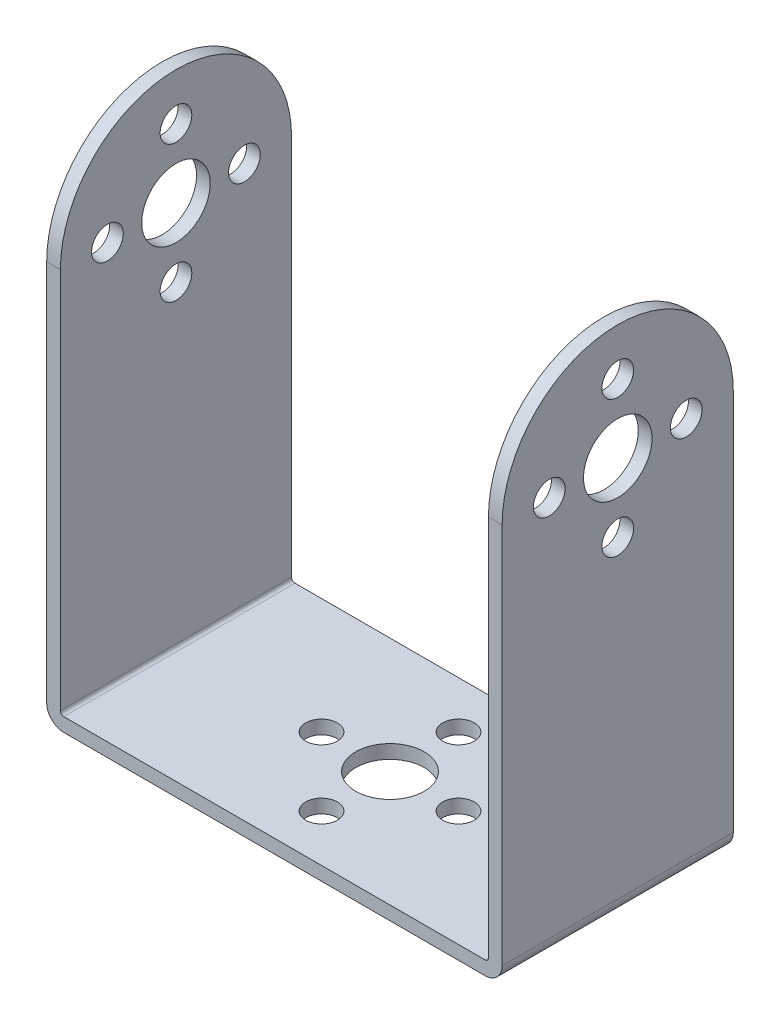
ISO-10303-21;
HEADER;
FILE_DESCRIPTION(('STEP AP214'),'2;1');
FILE_NAME('part.step','',(''),(''),'','','');
FILE_SCHEMA(('AUTOMOTIVE_DESIGN { 1 0 10303 214 1 1 1 1 }'));
ENDSEC;
DATA;
#1=APPLICATION_CONTEXT('core data for automotive mechanical design processes');
#2=APPLICATION_PROTOCOL_DEFINITION('international standard','automotive_design',2000,#1);
#3=PRODUCT_CONTEXT('',#1,'mechanical');
#4=PRODUCT('Part','Part','',(#3));
#5=PRODUCT_RELATED_PRODUCT_CATEGORY('part','',(#4));
#6=PRODUCT_DEFINITION_FORMATION('','',#4);
#7=PRODUCT_DEFINITION_CONTEXT('part definition',#1,'design');
#8=PRODUCT_DEFINITION('design','',#6,#7);
#9=PRODUCT_DEFINITION_SHAPE('','',#8);
#10=(LENGTH_UNIT() NAMED_UNIT(*) SI_UNIT(.MILLI.,.METRE.));
#11=(NAMED_UNIT(*) PLANE_ANGLE_UNIT() SI_UNIT($,.RADIAN.));
#12=(NAMED_UNIT(*) SI_UNIT($,.STERADIAN.) SOLID_ANGLE_UNIT());
#13=UNCERTAINTY_MEASURE_WITH_UNIT(LENGTH_MEASURE(1.E-05),#10,'distance_accuracy_value','');
#14=(GEOMETRIC_REPRESENTATION_CONTEXT(3) GLOBAL_UNCERTAINTY_ASSIGNED_CONTEXT((#13)) GLOBAL_UNIT_ASSIGNED_CONTEXT((#10,
#11,#12)) REPRESENTATION_CONTEXT('',''));
#15=CARTESIAN_POINT('',(0.,0.,0.));
#16=DIRECTION('',(0.,0.,1.));
#17=DIRECTION('',(1.,0.,0.));
#18=AXIS2_PLACEMENT_3D('',#15,#16,#17);
#19=CARTESIAN_POINT('',(95.95152,45.,0.));
#20=DIRECTION('',(-1.,0.,0.));
#21=DIRECTION('',(0.,0.,1.));
#22=AXIS2_PLACEMENT_3D('',#19,#20,#21);
#23=CYLINDRICAL_SURFACE('',#22,13.5);
#24=DIRECTION('',(-1.,0.,0.));
#25=VECTOR('',#24,1.);
#26=CARTESIAN_POINT('',(95.95152,45.,-13.5));
#27=LINE('',#26,#25);
#28=CARTESIAN_POINT('',(-25.,45.,-13.5));
#29=VERTEX_POINT('',#28);
#30=CARTESIAN_POINT('',(-26.6,45.,-13.5));
#31=VERTEX_POINT('',#30);
#32=EDGE_CURVE('E105',#29,#31,#27,.T.);
#33=ORIENTED_EDGE('',*,*,#32,.T.);
#34=CARTESIAN_POINT('',(-26.6,45.,0.));
#35=DIRECTION('',(-1.,0.,0.));
#36=DIRECTION('',(0.,0.,1.));
#37=AXIS2_PLACEMENT_3D('',#34,#35,#36);
#38=CIRCLE('',#37,13.5);
#39=CARTESIAN_POINT('',(-26.6,45.,13.5));
#40=VERTEX_POINT('',#39);
#41=EDGE_CURVE('E258',#40,#31,#38,.T.);
#42=ORIENTED_EDGE('',*,*,#41,.F.);
#43=DIRECTION('',(-1.,0.,0.));
#44=VECTOR('',#43,1.);
#45=CARTESIAN_POINT('',(95.95152,45.,13.5));
#46=LINE('',#45,#44);
#47=CARTESIAN_POINT('',(-25.,45.,13.5));
#48=VERTEX_POINT('',#47);
#49=EDGE_CURVE('E174',#40,#48,#46,.F.);
#50=ORIENTED_EDGE('',*,*,#49,.T.);
#51=CARTESIAN_POINT('',(-25.,45.,0.));
#52=DIRECTION('',(-1.,0.,0.));
#53=DIRECTION('',(0.,0.,1.));
#54=AXIS2_PLACEMENT_3D('',#51,#52,#53);
#55=CIRCLE('',#54,13.5);
#56=EDGE_CURVE('E168',#29,#48,#55,.F.);
#57=ORIENTED_EDGE('',*,*,#56,.F.);
#58=EDGE_LOOP('',(#33,#42,#50,#57));
#59=FACE_BOUND('',#58,.T.);
#60=ADVANCED_FACE('F15',(#59),#23,.T.);
#61=CARTESIAN_POINT('',(-31.92,45.,0.));
#62=DIRECTION('',(1.,0.,0.));
#63=DIRECTION('',(0.,0.,-1.));
#64=AXIS2_PLACEMENT_3D('',#61,#62,#63);
#65=CYLINDRICAL_SURFACE('',#64,4.);
#66=CARTESIAN_POINT('',(-25.,45.,0.));
#67=DIRECTION('',(1.,0.,0.));
#68=DIRECTION('',(0.,0.,-1.));
#69=AXIS2_PLACEMENT_3D('',#66,#67,#68);
#70=CIRCLE('',#69,4.);
#71=CARTESIAN_POINT('',(-25.,45.,-4.));
#72=VERTEX_POINT('',#71);
#73=EDGE_CURVE('E167',#72,#72,#70,.F.);
#74=ORIENTED_EDGE('',*,*,#73,.F.);
#75=EDGE_LOOP('',(#74));
#76=FACE_BOUND('',#75,.T.);
#77=CARTESIAN_POINT('',(-26.6,45.,0.));
#78=DIRECTION('',(1.,0.,0.));
#79=DIRECTION('',(0.,0.,-1.));
#80=AXIS2_PLACEMENT_3D('',#77,#78,#79);
#81=CIRCLE('',#80,4.);
#82=CARTESIAN_POINT('',(-26.6,45.,-4.));
#83=VERTEX_POINT('',#82);
#84=EDGE_CURVE('E255',#83,#83,#81,.T.);
#85=ORIENTED_EDGE('',*,*,#84,.F.);
#86=EDGE_LOOP('',(#85));
#87=FACE_BOUND('',#86,.T.);
#88=ADVANCED_FACE('F415',(#76,#87),#65,.F.);
#89=CARTESIAN_POINT('',(-31.92,53.,0.));
#90=DIRECTION('',(1.,0.,0.));
#91=DIRECTION('',(0.,0.,-1.));
#92=AXIS2_PLACEMENT_3D('',#89,#90,#91);
#93=CYLINDRICAL_SURFACE('',#92,1.85);
#94=CARTESIAN_POINT('',(-25.,53.,0.));
#95=DIRECTION('',(1.,0.,0.));
#96=DIRECTION('',(0.,0.,-1.));
#97=AXIS2_PLACEMENT_3D('',#94,#95,#96);
#98=CIRCLE('',#97,1.85);
#99=CARTESIAN_POINT('',(-25.,53.,-1.85));
#100=VERTEX_POINT('',#99);
#101=EDGE_CURVE('E270',#100,#100,#98,.F.);
#102=ORIENTED_EDGE('',*,*,#101,.F.);
#103=EDGE_LOOP('',(#102));
#104=FACE_BOUND('',#103,.T.);
#105=CARTESIAN_POINT('',(-26.6,53.,0.));
#106=DIRECTION('',(1.,0.,0.));
#107=DIRECTION('',(0.,0.,-1.));
#108=AXIS2_PLACEMENT_3D('',#105,#106,#107);
#109=CIRCLE('',#108,1.85);
#110=CARTESIAN_POINT('',(-26.6,53.,-1.85));
#111=VERTEX_POINT('',#110);
#112=EDGE_CURVE('E252',#111,#111,#109,.T.);
#113=ORIENTED_EDGE('',*,*,#112,.F.);
#114=EDGE_LOOP('',(#113));
#115=FACE_BOUND('',#114,.T.);
#116=ADVANCED_FACE('F412',(#104,#115),#93,.F.);
#117=CARTESIAN_POINT('',(-31.92,45.,-8.));
#118=DIRECTION('',(1.,0.,0.));
#119=DIRECTION('',(0.,0.,-1.));
#120=AXIS2_PLACEMENT_3D('',#117,#118,#119);
#121=CYLINDRICAL_SURFACE('',#120,1.85);
#122=CARTESIAN_POINT('',(-25.,45.,-8.));
#123=DIRECTION('',(1.,0.,0.));
#124=DIRECTION('',(0.,0.,-1.));
#125=AXIS2_PLACEMENT_3D('',#122,#123,#124);
#126=CIRCLE('',#125,1.85);
#127=CARTESIAN_POINT('',(-25.,45.,-9.85));
#128=VERTEX_POINT('',#127);
#129=EDGE_CURVE('E267',#128,#128,#126,.F.);
#130=ORIENTED_EDGE('',*,*,#129,.F.);
#131=EDGE_LOOP('',(#130));
#132=FACE_BOUND('',#131,.T.);
#133=CARTESIAN_POINT('',(-26.6,45.,-8.));
#134=DIRECTION('',(1.,0.,0.));
#135=DIRECTION('',(0.,0.,-1.));
#136=AXIS2_PLACEMENT_3D('',#133,#134,#135);
#137=CIRCLE('',#136,1.85);
#138=CARTESIAN_POINT('',(-26.6,45.,-9.85));
#139=VERTEX_POINT('',#138);
#140=EDGE_CURVE('E249',#139,#139,#137,.T.);
#141=ORIENTED_EDGE('',*,*,#140,.F.);
#142=EDGE_LOOP('',(#141));
#143=FACE_BOUND('',#142,.T.);
#144=ADVANCED_FACE('F408',(#132,#143),#121,.F.);
#145=CARTESIAN_POINT('',(-31.92,37.,0.));
#146=DIRECTION('',(1.,0.,0.));
#147=DIRECTION('',(0.,0.,-1.));
#148=AXIS2_PLACEMENT_3D('',#145,#146,#147);
#149=CYLINDRICAL_SURFACE('',#148,1.85);
#150=CARTESIAN_POINT('',(-25.,37.,0.));
#151=DIRECTION('',(1.,0.,0.));
#152=DIRECTION('',(0.,0.,-1.));
#153=AXIS2_PLACEMENT_3D('',#150,#151,#152);
#154=CIRCLE('',#153,1.85);
#155=CARTESIAN_POINT('',(-25.,37.,-1.85));
#156=VERTEX_POINT('',#155);
#157=EDGE_CURVE('E264',#156,#156,#154,.F.);
#158=ORIENTED_EDGE('',*,*,#157,.F.);
#159=EDGE_LOOP('',(#158));
#160=FACE_BOUND('',#159,.T.);
#161=CARTESIAN_POINT('',(-26.6,37.,0.));
#162=DIRECTION('',(1.,0.,0.));
#163=DIRECTION('',(0.,0.,-1.));
#164=AXIS2_PLACEMENT_3D('',#161,#162,#163);
#165=CIRCLE('',#164,1.85);
#166=CARTESIAN_POINT('',(-26.6,37.,-1.85));
#167=VERTEX_POINT('',#166);
#168=EDGE_CURVE('E246',#167,#167,#165,.T.);
#169=ORIENTED_EDGE('',*,*,#168,.F.);
#170=EDGE_LOOP('',(#169));
#171=FACE_BOUND('',#170,.T.);
#172=ADVANCED_FACE('F404',(#160,#171),#149,.F.);
#173=CARTESIAN_POINT('',(-31.92,45.,8.));
#174=DIRECTION('',(1.,0.,0.));
#175=DIRECTION('',(0.,0.,-1.));
#176=AXIS2_PLACEMENT_3D('',#173,#174,#175);
#177=CYLINDRICAL_SURFACE('',#176,1.85);
#178=CARTESIAN_POINT('',(-25.,45.,8.));
#179=DIRECTION('',(1.,0.,0.));
#180=DIRECTION('',(0.,0.,-1.));
#181=AXIS2_PLACEMENT_3D('',#178,#179,#180);
#182=CIRCLE('',#181,1.85);
#183=CARTESIAN_POINT('',(-25.,45.,6.15));
#184=VERTEX_POINT('',#183);
#185=EDGE_CURVE('E261',#184,#184,#182,.F.);
#186=ORIENTED_EDGE('',*,*,#185,.F.);
#187=EDGE_LOOP('',(#186));
#188=FACE_BOUND('',#187,.T.);
#189=CARTESIAN_POINT('',(-26.6,45.,8.));
#190=DIRECTION('',(1.,0.,0.));
#191=DIRECTION('',(0.,0.,-1.));
#192=AXIS2_PLACEMENT_3D('',#189,#190,#191);
#193=CIRCLE('',#192,1.85);
#194=CARTESIAN_POINT('',(-26.6,45.,6.15));
#195=VERTEX_POINT('',#194);
#196=EDGE_CURVE('E165',#195,#195,#193,.T.);
#197=ORIENTED_EDGE('',*,*,#196,.F.);
#198=EDGE_LOOP('',(#197));
#199=FACE_BOUND('',#198,.T.);
#200=ADVANCED_FACE('F401',(#188,#199),#177,.F.);
#201=CARTESIAN_POINT('',(-24.6,0.4,-48.6972));
#202=DIRECTION('',(0.,0.,1.));
#203=DIRECTION('',(1.,0.,0.));
#204=AXIS2_PLACEMENT_3D('',#201,#202,#203);
#205=CYLINDRICAL_SURFACE('',#204,0.4);
#206=DIRECTION('',(0.,0.,1.));
#207=VECTOR('',#206,1.);
#208=CARTESIAN_POINT('',(-24.6,0.,-13.5));
#209=LINE('',#208,#207);
#210=CARTESIAN_POINT('',(-24.6,0.,-13.5));
#211=VERTEX_POINT('',#210);
#212=CARTESIAN_POINT('',(-24.6,0.,13.5));
#213=VERTEX_POINT('',#212);
#214=EDGE_CURVE('E107',#211,#213,#209,.T.);
#215=ORIENTED_EDGE('',*,*,#214,.F.);
#216=CARTESIAN_POINT('',(-24.6,0.4,-13.5));
#217=DIRECTION('',(0.,0.,1.));
#218=DIRECTION('',(1.,0.,0.));
#219=AXIS2_PLACEMENT_3D('',#216,#217,#218);
#220=CIRCLE('',#219,0.4);
#221=CARTESIAN_POINT('',(-25.,0.4,-13.5));
#222=VERTEX_POINT('',#221);
#223=EDGE_CURVE('E18',#222,#211,#220,.T.);
#224=ORIENTED_EDGE('',*,*,#223,.F.);
#225=DIRECTION('',(0.,0.,-1.));
#226=VECTOR('',#225,1.);
#227=CARTESIAN_POINT('',(-25.,0.4,-13.5));
#228=LINE('',#227,#226);
#229=CARTESIAN_POINT('',(-25.,0.4,13.5));
#230=VERTEX_POINT('',#229);
#231=EDGE_CURVE('E166',#230,#222,#228,.T.);
#232=ORIENTED_EDGE('',*,*,#231,.F.);
#233=CARTESIAN_POINT('',(-24.6,0.4,13.5));
#234=DIRECTION('',(0.,0.,1.));
#235=DIRECTION('',(1.,0.,0.));
#236=AXIS2_PLACEMENT_3D('',#233,#234,#235);
#237=CIRCLE('',#236,0.4);
#238=EDGE_CURVE('E104',#213,#230,#237,.F.);
#239=ORIENTED_EDGE('',*,*,#238,.F.);
#240=EDGE_LOOP('',(#215,#224,#232,#239));
#241=FACE_BOUND('',#240,.T.);
#242=ADVANCED_FACE('F108',(#241),#205,.F.);
#243=CARTESIAN_POINT('',(0.,0.,0.));
#244=DIRECTION('',(0.,1.,0.));
#245=DIRECTION('',(0.,0.,1.));
#246=AXIS2_PLACEMENT_3D('',#243,#244,#245);
#247=CYLINDRICAL_SURFACE('',#246,4.);
#248=CARTESIAN_POINT('',(0.,-1.6,0.));
#249=DIRECTION('',(0.,1.,0.));
#250=DIRECTION('',(0.,0.,1.));
#251=AXIS2_PLACEMENT_3D('',#248,#249,#250);
#252=CIRCLE('',#251,4.);
#253=CARTESIAN_POINT('',(0.,-1.6,4.));
#254=VERTEX_POINT('',#253);
#255=EDGE_CURVE('E162',#254,#254,#252,.T.);
#256=ORIENTED_EDGE('',*,*,#255,.F.);
#257=EDGE_LOOP('',(#256));
#258=FACE_BOUND('',#257,.T.);
#259=CARTESIAN_POINT('',(0.,0.,0.));
#260=DIRECTION('',(0.,1.,0.));
#261=DIRECTION('',(0.,0.,1.));
#262=AXIS2_PLACEMENT_3D('',#259,#260,#261);
#263=CIRCLE('',#262,4.);
#264=CARTESIAN_POINT('',(0.,0.,4.));
#265=VERTEX_POINT('',#264);
#266=EDGE_CURVE('E112',#265,#265,#263,.F.);
#267=ORIENTED_EDGE('',*,*,#266,.F.);
#268=EDGE_LOOP('',(#267));
#269=FACE_BOUND('',#268,.T.);
#270=ADVANCED_FACE('F394',(#258,#269),#247,.F.);
#271=CARTESIAN_POINT('',(0.,0.,-8.));
#272=DIRECTION('',(0.,1.,0.));
#273=DIRECTION('',(0.,0.,1.));
#274=AXIS2_PLACEMENT_3D('',#271,#272,#273);
#275=CYLINDRICAL_SURFACE('',#274,1.85);
#276=CARTESIAN_POINT('',(0.,-1.6,-8.));
#277=DIRECTION('',(0.,1.,0.));
#278=DIRECTION('',(0.,0.,1.));
#279=AXIS2_PLACEMENT_3D('',#276,#277,#278);
#280=CIRCLE('',#279,1.85);
#281=CARTESIAN_POINT('',(0.,-1.6,-6.15));
#282=VERTEX_POINT('',#281);
#283=EDGE_CURVE('E239',#282,#282,#280,.T.);
#284=ORIENTED_EDGE('',*,*,#283,.F.);
#285=EDGE_LOOP('',(#284));
#286=FACE_BOUND('',#285,.T.);
#287=CARTESIAN_POINT('',(0.,0.,-8.));
#288=DIRECTION('',(0.,1.,0.));
#289=DIRECTION('',(0.,0.,1.));
#290=AXIS2_PLACEMENT_3D('',#287,#288,#289);
#291=CIRCLE('',#290,1.85);
#292=CARTESIAN_POINT('',(0.,0.,-6.15));
#293=VERTEX_POINT('',#292);
#294=EDGE_CURVE('E226',#293,#293,#291,.F.);
#295=ORIENTED_EDGE('',*,*,#294,.F.);
#296=EDGE_LOOP('',(#295));
#297=FACE_BOUND('',#296,.T.);
#298=ADVANCED_FACE('F390',(#286,#297),#275,.F.);
#299=CARTESIAN_POINT('',(8.,0.,0.));
#300=DIRECTION('',(0.,1.,0.));
#301=DIRECTION('',(0.,0.,1.));
#302=AXIS2_PLACEMENT_3D('',#299,#300,#301);
#303=CYLINDRICAL_SURFACE('',#302,1.85);
#304=CARTESIAN_POINT('',(8.,-1.6,0.));
#305=DIRECTION('',(0.,1.,0.));
#306=DIRECTION('',(0.,0.,1.));
#307=AXIS2_PLACEMENT_3D('',#304,#305,#306);
#308=CIRCLE('',#307,1.85);
#309=CARTESIAN_POINT('',(8.,-1.6,1.85));
#310=VERTEX_POINT('',#309);
#311=EDGE_CURVE('E236',#310,#310,#308,.T.);
#312=ORIENTED_EDGE('',*,*,#311,.F.);
#313=EDGE_LOOP('',(#312));
#314=FACE_BOUND('',#313,.T.);
#315=CARTESIAN_POINT('',(8.,0.,0.));
#316=DIRECTION('',(0.,1.,0.));
#317=DIRECTION('',(0.,0.,1.));
#318=AXIS2_PLACEMENT_3D('',#315,#316,#317);
#319=CIRCLE('',#318,1.85);
#320=CARTESIAN_POINT('',(8.,0.,1.85));
#321=VERTEX_POINT('',#320);
#322=EDGE_CURVE('E223',#321,#321,#319,.F.);
#323=ORIENTED_EDGE('',*,*,#322,.F.);
#324=EDGE_LOOP('',(#323));
#325=FACE_BOUND('',#324,.T.);
#326=ADVANCED_FACE('F386',(#314,#325),#303,.F.);
#327=CARTESIAN_POINT('',(0.,0.,8.));
#328=DIRECTION('',(0.,1.,0.));
#329=DIRECTION('',(0.,0.,1.));
#330=AXIS2_PLACEMENT_3D('',#327,#328,#329);
#331=CYLINDRICAL_SURFACE('',#330,1.85);
#332=CARTESIAN_POINT('',(0.,-1.6,8.));
#333=DIRECTION('',(0.,1.,0.));
#334=DIRECTION('',(0.,0.,1.));
#335=AXIS2_PLACEMENT_3D('',#332,#333,#334);
#336=CIRCLE('',#335,1.85);
#337=CARTESIAN_POINT('',(0.,-1.6,9.85));
#338=VERTEX_POINT('',#337);
#339=EDGE_CURVE('E233',#338,#338,#336,.T.);
#340=ORIENTED_EDGE('',*,*,#339,.F.);
#341=EDGE_LOOP('',(#340));
#342=FACE_BOUND('',#341,.T.);
#343=CARTESIAN_POINT('',(0.,0.,8.));
#344=DIRECTION('',(0.,1.,0.));
#345=DIRECTION('',(0.,0.,1.));
#346=AXIS2_PLACEMENT_3D('',#343,#344,#345);
#347=CIRCLE('',#346,1.85);
#348=CARTESIAN_POINT('',(0.,0.,9.85));
#349=VERTEX_POINT('',#348);
#350=EDGE_CURVE('E220',#349,#349,#347,.F.);
#351=ORIENTED_EDGE('',*,*,#350,.F.);
#352=EDGE_LOOP('',(#351));
#353=FACE_BOUND('',#352,.T.);
#354=ADVANCED_FACE('F382',(#342,#353),#331,.F.);
#355=CARTESIAN_POINT('',(-8.,0.,0.));
#356=DIRECTION('',(0.,1.,0.));
#357=DIRECTION('',(0.,0.,1.));
#358=AXIS2_PLACEMENT_3D('',#355,#356,#357);
#359=CYLINDRICAL_SURFACE('',#358,1.85);
#360=CARTESIAN_POINT('',(-8.,-1.6,0.));
#361=DIRECTION('',(0.,1.,0.));
#362=DIRECTION('',(0.,0.,1.));
#363=AXIS2_PLACEMENT_3D('',#360,#361,#362);
#364=CIRCLE('',#363,1.85);
#365=CARTESIAN_POINT('',(-8.,-1.6,1.85));
#366=VERTEX_POINT('',#365);
#367=EDGE_CURVE('E113',#366,#366,#364,.T.);
#368=ORIENTED_EDGE('',*,*,#367,.F.);
#369=EDGE_LOOP('',(#368));
#370=FACE_BOUND('',#369,.T.);
#371=CARTESIAN_POINT('',(-8.,0.,0.));
#372=DIRECTION('',(0.,1.,0.));
#373=DIRECTION('',(0.,0.,1.));
#374=AXIS2_PLACEMENT_3D('',#371,#372,#373);
#375=CIRCLE('',#374,1.85);
#376=CARTESIAN_POINT('',(-8.,0.,1.85));
#377=VERTEX_POINT('',#376);
#378=EDGE_CURVE('E172',#377,#377,#375,.F.);
#379=ORIENTED_EDGE('',*,*,#378,.F.);
#380=EDGE_LOOP('',(#379));
#381=FACE_BOUND('',#380,.T.);
#382=ADVANCED_FACE('F379',(#370,#381),#359,.F.);
#383=CARTESIAN_POINT('',(24.6,0.4,48.6972));
#384=DIRECTION('',(0.,0.,-1.));
#385=DIRECTION('',(-1.,0.,0.));
#386=AXIS2_PLACEMENT_3D('',#383,#384,#385);
#387=CYLINDRICAL_SURFACE('',#386,2.);
#388=DIRECTION('',(0.,0.,-1.));
#389=VECTOR('',#388,1.);
#390=CARTESIAN_POINT('',(24.6,-1.6,-13.5));
#391=LINE('',#390,#389);
#392=CARTESIAN_POINT('',(24.6,-1.6,-13.5));
#393=VERTEX_POINT('',#392);
#394=CARTESIAN_POINT('',(24.6,-1.6,13.5));
#395=VERTEX_POINT('',#394);
#396=EDGE_CURVE('E159',#393,#395,#391,.F.);
#397=ORIENTED_EDGE('',*,*,#396,.F.);
#398=CARTESIAN_POINT('',(24.6,0.4,-13.5));
#399=DIRECTION('',(0.,0.,-1.));
#400=DIRECTION('',(-1.,0.,0.));
#401=AXIS2_PLACEMENT_3D('',#398,#399,#400);
#402=CIRCLE('',#401,2.);
#403=CARTESIAN_POINT('',(26.6,0.4,-13.5));
#404=VERTEX_POINT('',#403);
#405=EDGE_CURVE('E127',#393,#404,#402,.F.);
#406=ORIENTED_EDGE('',*,*,#405,.T.);
#407=DIRECTION('',(0.,0.,-1.));
#408=VECTOR('',#407,1.);
#409=CARTESIAN_POINT('',(26.6,0.4,-13.5));
#410=LINE('',#409,#408);
#411=CARTESIAN_POINT('',(26.6,0.4,13.5));
#412=VERTEX_POINT('',#411);
#413=EDGE_CURVE('E153',#412,#404,#410,.T.);
#414=ORIENTED_EDGE('',*,*,#413,.F.);
#415=CARTESIAN_POINT('',(24.6,0.4,13.5));
#416=DIRECTION('',(0.,0.,-1.));
#417=DIRECTION('',(-1.,0.,0.));
#418=AXIS2_PLACEMENT_3D('',#415,#416,#417);
#419=CIRCLE('',#418,2.);
#420=EDGE_CURVE('E138',#395,#412,#419,.F.);
#421=ORIENTED_EDGE('',*,*,#420,.F.);
#422=EDGE_LOOP('',(#397,#406,#414,#421));
#423=FACE_BOUND('',#422,.T.);
#424=ADVANCED_FACE('F301',(#423),#387,.T.);
#425=CARTESIAN_POINT('',(-25.,0.,-13.5));
#426=DIRECTION('',(1.,0.,0.));
#427=DIRECTION('',(0.,0.,-1.));
#428=AXIS2_PLACEMENT_3D('',#425,#426,#427);
#429=PLANE('',#428);
#430=ORIENTED_EDGE('',*,*,#185,.T.);
#431=EDGE_LOOP('',(#430));
#432=FACE_BOUND('',#431,.T.);
#433=ORIENTED_EDGE('',*,*,#157,.T.);
#434=EDGE_LOOP('',(#433));
#435=FACE_BOUND('',#434,.T.);
#436=ORIENTED_EDGE('',*,*,#129,.T.);
#437=EDGE_LOOP('',(#436));
#438=FACE_BOUND('',#437,.T.);
#439=ORIENTED_EDGE('',*,*,#101,.T.);
#440=EDGE_LOOP('',(#439));
#441=FACE_BOUND('',#440,.T.);
#442=ORIENTED_EDGE('',*,*,#73,.T.);
#443=EDGE_LOOP('',(#442));
#444=FACE_BOUND('',#443,.T.);
#445=DIRECTION('',(0.,1.,0.));
#446=VECTOR('',#445,1.);
#447=CARTESIAN_POINT('',(-25.,0.,13.5));
#448=LINE('',#447,#446);
#449=EDGE_CURVE('E146',#230,#48,#448,.T.);
#450=ORIENTED_EDGE('',*,*,#449,.F.);
#451=ORIENTED_EDGE('',*,*,#231,.T.);
#452=DIRECTION('',(0.,1.,0.));
#453=VECTOR('',#452,1.);
#454=CARTESIAN_POINT('',(-25.,0.,-13.5));
#455=LINE('',#454,#453);
#456=EDGE_CURVE('E103',#222,#29,#455,.T.);
#457=ORIENTED_EDGE('',*,*,#456,.T.);
#458=ORIENTED_EDGE('',*,*,#56,.T.);
#459=EDGE_LOOP('',(#450,#451,#457,#458));
#460=FACE_BOUND('',#459,.T.);
#461=ADVANCED_FACE('F280',(#432,#435,#438,#441,#444,#460),#429,.T.);
#462=CARTESIAN_POINT('',(-26.6,58.5,-13.5));
#463=DIRECTION('',(-1.,0.,0.));
#464=DIRECTION('',(0.,0.,1.));
#465=AXIS2_PLACEMENT_3D('',#462,#463,#464);
#466=PLANE('',#465);
#467=ORIENTED_EDGE('',*,*,#196,.T.);
#468=EDGE_LOOP('',(#467));
#469=FACE_BOUND('',#468,.T.);
#470=ORIENTED_EDGE('',*,*,#168,.T.);
#471=EDGE_LOOP('',(#470));
#472=FACE_BOUND('',#471,.T.);
#473=ORIENTED_EDGE('',*,*,#140,.T.);
#474=EDGE_LOOP('',(#473));
#475=FACE_BOUND('',#474,.T.);
#476=ORIENTED_EDGE('',*,*,#112,.T.);
#477=EDGE_LOOP('',(#476));
#478=FACE_BOUND('',#477,.T.);
#479=ORIENTED_EDGE('',*,*,#84,.T.);
#480=EDGE_LOOP('',(#479));
#481=FACE_BOUND('',#480,.T.);
#482=DIRECTION('',(0.,1.,0.));
#483=VECTOR('',#482,1.);
#484=CARTESIAN_POINT('',(-26.6,0.,-13.5));
#485=LINE('',#484,#483);
#486=CARTESIAN_POINT('',(-26.6,0.399999999999999,-13.5));
#487=VERTEX_POINT('',#486);
#488=EDGE_CURVE('E121',#31,#487,#485,.F.);
#489=ORIENTED_EDGE('',*,*,#488,.T.);
#490=DIRECTION('',(0.,0.,-1.));
#491=VECTOR('',#490,1.);
#492=CARTESIAN_POINT('',(-26.6,0.399999999999998,48.6972));
#493=LINE('',#492,#491);
#494=CARTESIAN_POINT('',(-26.6,0.399999999999999,13.5));
#495=VERTEX_POINT('',#494);
#496=EDGE_CURVE('E160',#495,#487,#493,.T.);
#497=ORIENTED_EDGE('',*,*,#496,.F.);
#498=DIRECTION('',(0.,1.,0.));
#499=VECTOR('',#498,1.);
#500=CARTESIAN_POINT('',(-26.6,0.,13.5));
#501=LINE('',#500,#499);
#502=EDGE_CURVE('E143',#40,#495,#501,.F.);
#503=ORIENTED_EDGE('',*,*,#502,.F.);
#504=ORIENTED_EDGE('',*,*,#41,.T.);
#505=EDGE_LOOP('',(#489,#497,#503,#504));
#506=FACE_BOUND('',#505,.T.);
#507=ADVANCED_FACE('F287',(#469,#472,#475,#478,#481,#506),#466,.T.);
#508=CARTESIAN_POINT('',(-24.6,0.4,48.6972));
#509=DIRECTION('',(0.,0.,-1.));
#510=DIRECTION('',(0.,1.,0.));
#511=AXIS2_PLACEMENT_3D('',#508,#509,#510);
#512=CYLINDRICAL_SURFACE('',#511,2.);
#513=ORIENTED_EDGE('',*,*,#496,.T.);
#514=CARTESIAN_POINT('',(-24.6,0.4,-13.5));
#515=DIRECTION('',(0.,0.,-1.));
#516=DIRECTION('',(0.,1.,0.));
#517=AXIS2_PLACEMENT_3D('',#514,#515,#516);
#518=CIRCLE('',#517,2.);
#519=CARTESIAN_POINT('',(-24.6,-1.6,-13.5));
#520=VERTEX_POINT('',#519);
#521=EDGE_CURVE('E209',#487,#520,#518,.F.);
#522=ORIENTED_EDGE('',*,*,#521,.T.);
#523=DIRECTION('',(0.,0.,-1.));
#524=VECTOR('',#523,1.);
#525=CARTESIAN_POINT('',(-24.6,-1.6,-13.5));
#526=LINE('',#525,#524);
#527=CARTESIAN_POINT('',(-24.6,-1.6,13.5));
#528=VERTEX_POINT('',#527);
#529=EDGE_CURVE('E156',#528,#520,#526,.T.);
#530=ORIENTED_EDGE('',*,*,#529,.F.);
#531=CARTESIAN_POINT('',(-24.6,0.4,13.5));
#532=DIRECTION('',(0.,0.,-1.));
#533=DIRECTION('',(0.,1.,0.));
#534=AXIS2_PLACEMENT_3D('',#531,#532,#533);
#535=CIRCLE('',#534,2.);
#536=EDGE_CURVE('E142',#495,#528,#535,.F.);
#537=ORIENTED_EDGE('',*,*,#536,.F.);
#538=EDGE_LOOP('',(#513,#522,#530,#537));
#539=FACE_BOUND('',#538,.T.);
#540=ADVANCED_FACE('F290',(#539),#512,.T.);
#541=CARTESIAN_POINT('',(-26.6,-1.6,-13.5));
#542=DIRECTION('',(0.,-1.,0.));
#543=DIRECTION('',(0.,0.,-1.));
#544=AXIS2_PLACEMENT_3D('',#541,#542,#543);
#545=PLANE('',#544);
#546=ORIENTED_EDGE('',*,*,#367,.T.);
#547=EDGE_LOOP('',(#546));
#548=FACE_BOUND('',#547,.T.);
#549=ORIENTED_EDGE('',*,*,#339,.T.);
#550=EDGE_LOOP('',(#549));
#551=FACE_BOUND('',#550,.T.);
#552=ORIENTED_EDGE('',*,*,#311,.T.);
#553=EDGE_LOOP('',(#552));
#554=FACE_BOUND('',#553,.T.);
#555=ORIENTED_EDGE('',*,*,#283,.T.);
#556=EDGE_LOOP('',(#555));
#557=FACE_BOUND('',#556,.T.);
#558=ORIENTED_EDGE('',*,*,#255,.T.);
#559=EDGE_LOOP('',(#558));
#560=FACE_BOUND('',#559,.T.);
#561=DIRECTION('',(1.,0.,0.));
#562=VECTOR('',#561,1.);
#563=CARTESIAN_POINT('',(0.,-1.6,-13.5));
#564=LINE('',#563,#562);
#565=EDGE_CURVE('E155',#520,#393,#564,.T.);
#566=ORIENTED_EDGE('',*,*,#565,.T.);
#567=ORIENTED_EDGE('',*,*,#396,.T.);
#568=DIRECTION('',(1.,0.,0.));
#569=VECTOR('',#568,1.);
#570=CARTESIAN_POINT('',(0.,-1.6,13.5));
#571=LINE('',#570,#569);
#572=EDGE_CURVE('E139',#528,#395,#571,.T.);
#573=ORIENTED_EDGE('',*,*,#572,.F.);
#574=ORIENTED_EDGE('',*,*,#529,.T.);
#575=EDGE_LOOP('',(#566,#567,#573,#574));
#576=FACE_BOUND('',#575,.T.);
#577=ADVANCED_FACE('F295',(#548,#551,#554,#557,#560,#576),#545,.T.);
#578=CARTESIAN_POINT('',(25.,0.,-13.5));
#579=DIRECTION('',(0.,1.,0.));
#580=DIRECTION('',(0.,0.,1.));
#581=AXIS2_PLACEMENT_3D('',#578,#579,#580);
#582=PLANE('',#581);
#583=ORIENTED_EDGE('',*,*,#378,.T.);
#584=EDGE_LOOP('',(#583));
#585=FACE_BOUND('',#584,.T.);
#586=ORIENTED_EDGE('',*,*,#350,.T.);
#587=EDGE_LOOP('',(#586));
#588=FACE_BOUND('',#587,.T.);
#589=ORIENTED_EDGE('',*,*,#322,.T.);
#590=EDGE_LOOP('',(#589));
#591=FACE_BOUND('',#590,.T.);
#592=ORIENTED_EDGE('',*,*,#294,.T.);
#593=EDGE_LOOP('',(#592));
#594=FACE_BOUND('',#593,.T.);
#595=ORIENTED_EDGE('',*,*,#266,.T.);
#596=EDGE_LOOP('',(#595));
#597=FACE_BOUND('',#596,.T.);
#598=DIRECTION('',(1.,0.,0.));
#599=VECTOR('',#598,1.);
#600=CARTESIAN_POINT('',(0.,0.,-13.5));
#601=LINE('',#600,#599);
#602=CARTESIAN_POINT('',(24.6,0.,-13.5));
#603=VERTEX_POINT('',#602);
#604=EDGE_CURVE('E101',#603,#211,#601,.F.);
#605=ORIENTED_EDGE('',*,*,#604,.T.);
#606=ORIENTED_EDGE('',*,*,#214,.T.);
#607=DIRECTION('',(1.,0.,0.));
#608=VECTOR('',#607,1.);
#609=CARTESIAN_POINT('',(0.,0.,13.5));
#610=LINE('',#609,#608);
#611=CARTESIAN_POINT('',(24.6,0.,13.5));
#612=VERTEX_POINT('',#611);
#613=EDGE_CURVE('E149',#612,#213,#610,.F.);
#614=ORIENTED_EDGE('',*,*,#613,.F.);
#615=DIRECTION('',(0.,0.,1.));
#616=VECTOR('',#615,1.);
#617=CARTESIAN_POINT('',(24.6,0.,-48.6972));
#618=LINE('',#617,#616);
#619=EDGE_CURVE('E118',#612,#603,#618,.F.);
#620=ORIENTED_EDGE('',*,*,#619,.T.);
#621=EDGE_LOOP('',(#605,#606,#614,#620));
#622=FACE_BOUND('',#621,.T.);
#623=ADVANCED_FACE('F116',(#585,#588,#591,#594,#597,#622),#582,.T.);
#624=CARTESIAN_POINT('',(26.6,-1.6,-13.5));
#625=DIRECTION('',(1.,0.,0.));
#626=DIRECTION('',(0.,0.,-1.));
#627=AXIS2_PLACEMENT_3D('',#624,#625,#626);
#628=PLANE('',#627);
#629=CARTESIAN_POINT('',(26.6,45.,8.));
#630=DIRECTION('',(1.,0.,0.));
#631=DIRECTION('',(0.,0.,-1.));
#632=AXIS2_PLACEMENT_3D('',#629,#630,#631);
#633=CIRCLE('',#632,1.85);
#634=CARTESIAN_POINT('',(26.6,45.,6.15));
#635=VERTEX_POINT('',#634);
#636=EDGE_CURVE('E190',#635,#635,#633,.F.);
#637=ORIENTED_EDGE('',*,*,#636,.T.);
#638=EDGE_LOOP('',(#637));
#639=FACE_BOUND('',#638,.T.);
#640=CARTESIAN_POINT('',(26.6,37.,0.));
#641=DIRECTION('',(1.,0.,0.));
#642=DIRECTION('',(0.,0.,-1.));
#643=AXIS2_PLACEMENT_3D('',#640,#641,#642);
#644=CIRCLE('',#643,1.85);
#645=CARTESIAN_POINT('',(26.6,37.,-1.85));
#646=VERTEX_POINT('',#645);
#647=EDGE_CURVE('E193',#646,#646,#644,.F.);
#648=ORIENTED_EDGE('',*,*,#647,.T.);
#649=EDGE_LOOP('',(#648));
#650=FACE_BOUND('',#649,.T.);
#651=CARTESIAN_POINT('',(26.6,45.,-8.));
#652=DIRECTION('',(1.,0.,0.));
#653=DIRECTION('',(0.,0.,-1.));
#654=AXIS2_PLACEMENT_3D('',#651,#652,#653);
#655=CIRCLE('',#654,1.85);
#656=CARTESIAN_POINT('',(26.6,45.,-9.85));
#657=VERTEX_POINT('',#656);
#658=EDGE_CURVE('E196',#657,#657,#655,.F.);
#659=ORIENTED_EDGE('',*,*,#658,.T.);
#660=EDGE_LOOP('',(#659));
#661=FACE_BOUND('',#660,.T.);
#662=CARTESIAN_POINT('',(26.6,53.,0.));
#663=DIRECTION('',(1.,0.,0.));
#664=DIRECTION('',(0.,0.,-1.));
#665=AXIS2_PLACEMENT_3D('',#662,#663,#664);
#666=CIRCLE('',#665,1.85);
#667=CARTESIAN_POINT('',(26.6,53.,-1.85));
#668=VERTEX_POINT('',#667);
#669=EDGE_CURVE('E199',#668,#668,#666,.F.);
#670=ORIENTED_EDGE('',*,*,#669,.T.);
#671=EDGE_LOOP('',(#670));
#672=FACE_BOUND('',#671,.T.);
#673=CARTESIAN_POINT('',(26.6,45.,0.));
#674=DIRECTION('',(1.,0.,0.));
#675=DIRECTION('',(0.,0.,-1.));
#676=AXIS2_PLACEMENT_3D('',#673,#674,#675);
#677=CIRCLE('',#676,4.);
#678=CARTESIAN_POINT('',(26.6,45.,-4.));
#679=VERTEX_POINT('',#678);
#680=EDGE_CURVE('E202',#679,#679,#677,.F.);
#681=ORIENTED_EDGE('',*,*,#680,.T.);
#682=EDGE_LOOP('',(#681));
#683=FACE_BOUND('',#682,.T.);
#684=DIRECTION('',(0.,1.,0.));
#685=VECTOR('',#684,1.);
#686=CARTESIAN_POINT('',(26.6,0.,13.5));
#687=LINE('',#686,#685);
#688=CARTESIAN_POINT('',(26.6,45.,13.5));
#689=VERTEX_POINT('',#688);
#690=EDGE_CURVE('E151',#412,#689,#687,.T.);
#691=ORIENTED_EDGE('',*,*,#690,.F.);
#692=ORIENTED_EDGE('',*,*,#413,.T.);
#693=DIRECTION('',(0.,1.,0.));
#694=VECTOR('',#693,1.);
#695=CARTESIAN_POINT('',(26.6,0.,-13.5));
#696=LINE('',#695,#694);
#697=CARTESIAN_POINT('',(26.6,45.,-13.5));
#698=VERTEX_POINT('',#697);
#699=EDGE_CURVE('E123',#404,#698,#696,.T.);
#700=ORIENTED_EDGE('',*,*,#699,.T.);
#701=CARTESIAN_POINT('',(26.6,45.,0.));
#702=DIRECTION('',(-1.,0.,0.));
#703=DIRECTION('',(0.,0.,1.));
#704=AXIS2_PLACEMENT_3D('',#701,#702,#703);
#705=CIRCLE('',#704,13.5);
#706=EDGE_CURVE('E137',#689,#698,#705,.T.);
#707=ORIENTED_EDGE('',*,*,#706,.F.);
#708=EDGE_LOOP('',(#691,#692,#700,#707));
#709=FACE_BOUND('',#708,.T.);
#710=ADVANCED_FACE('F305',(#639,#650,#661,#672,#683,#709),#628,.T.);
#711=CARTESIAN_POINT('',(0.,0.,13.5));
#712=DIRECTION('',(0.,0.,1.));
#713=DIRECTION('',(1.,0.,0.));
#714=AXIS2_PLACEMENT_3D('',#711,#712,#713);
#715=PLANE('',#714);
#716=ORIENTED_EDGE('',*,*,#572,.T.);
#717=ORIENTED_EDGE('',*,*,#420,.T.);
#718=ORIENTED_EDGE('',*,*,#690,.T.);
#719=DIRECTION('',(-1.,0.,0.));
#720=VECTOR('',#719,1.);
#721=CARTESIAN_POINT('',(95.95152,45.,13.5));
#722=LINE('',#721,#720);
#723=CARTESIAN_POINT('',(25.,45.,13.5));
#724=VERTEX_POINT('',#723);
#725=EDGE_CURVE('E134',#724,#689,#722,.F.);
#726=ORIENTED_EDGE('',*,*,#725,.F.);
#727=DIRECTION('',(0.,1.,0.));
#728=VECTOR('',#727,1.);
#729=CARTESIAN_POINT('',(25.,58.5,13.5));
#730=LINE('',#729,#728);
#731=CARTESIAN_POINT('',(25.,0.399999999999999,13.5));
#732=VERTEX_POINT('',#731);
#733=EDGE_CURVE('E189',#732,#724,#730,.T.);
#734=ORIENTED_EDGE('',*,*,#733,.F.);
#735=CARTESIAN_POINT('',(24.6,0.4,13.5));
#736=DIRECTION('',(0.,0.,1.));
#737=DIRECTION('',(1.,0.,0.));
#738=AXIS2_PLACEMENT_3D('',#735,#736,#737);
#739=CIRCLE('',#738,0.4);
#740=EDGE_CURVE('E205',#732,#612,#739,.F.);
#741=ORIENTED_EDGE('',*,*,#740,.T.);
#742=ORIENTED_EDGE('',*,*,#613,.T.);
#743=ORIENTED_EDGE('',*,*,#238,.T.);
#744=ORIENTED_EDGE('',*,*,#449,.T.);
#745=ORIENTED_EDGE('',*,*,#49,.F.);
#746=ORIENTED_EDGE('',*,*,#502,.T.);
#747=ORIENTED_EDGE('',*,*,#536,.T.);
#748=EDGE_LOOP('',(#716,#717,#718,#726,#734,#741,#742,#743,#744,#745,#746,#747));
#749=FACE_BOUND('',#748,.T.);
#750=ADVANCED_FACE('F277',(#749),#715,.T.);
#751=CARTESIAN_POINT('',(95.95152,45.,0.));
#752=DIRECTION('',(-1.,0.,0.));
#753=DIRECTION('',(0.,0.,1.));
#754=AXIS2_PLACEMENT_3D('',#751,#752,#753);
#755=CYLINDRICAL_SURFACE('',#754,13.5);
#756=DIRECTION('',(1.,0.,0.));
#757=VECTOR('',#756,1.);
#758=CARTESIAN_POINT('',(0.,45.,-13.5));
#759=LINE('',#758,#757);
#760=CARTESIAN_POINT('',(25.,45.,-13.5));
#761=VERTEX_POINT('',#760);
#762=EDGE_CURVE('E119',#698,#761,#759,.F.);
#763=ORIENTED_EDGE('',*,*,#762,.T.);
#764=CARTESIAN_POINT('',(25.,45.,0.));
#765=DIRECTION('',(-1.,0.,0.));
#766=DIRECTION('',(0.,0.,1.));
#767=AXIS2_PLACEMENT_3D('',#764,#765,#766);
#768=CIRCLE('',#767,13.5);
#769=EDGE_CURVE('E186',#724,#761,#768,.T.);
#770=ORIENTED_EDGE('',*,*,#769,.F.);
#771=ORIENTED_EDGE('',*,*,#725,.T.);
#772=ORIENTED_EDGE('',*,*,#706,.T.);
#773=EDGE_LOOP('',(#763,#770,#771,#772));
#774=FACE_BOUND('',#773,.T.);
#775=ADVANCED_FACE('F309',(#774),#755,.T.);
#776=CARTESIAN_POINT('',(0.,0.,-13.5));
#777=DIRECTION('',(0.,0.,1.));
#778=DIRECTION('',(1.,0.,0.));
#779=AXIS2_PLACEMENT_3D('',#776,#777,#778);
#780=PLANE('',#779);
#781=ORIENTED_EDGE('',*,*,#521,.F.);
#782=ORIENTED_EDGE('',*,*,#488,.F.);
#783=ORIENTED_EDGE('',*,*,#32,.F.);
#784=ORIENTED_EDGE('',*,*,#456,.F.);
#785=ORIENTED_EDGE('',*,*,#223,.T.);
#786=ORIENTED_EDGE('',*,*,#604,.F.);
#787=CARTESIAN_POINT('',(24.6,0.4,-13.5));
#788=DIRECTION('',(0.,0.,1.));
#789=DIRECTION('',(1.,0.,0.));
#790=AXIS2_PLACEMENT_3D('',#787,#788,#789);
#791=CIRCLE('',#790,0.4);
#792=CARTESIAN_POINT('',(25.,0.399999999999999,-13.5));
#793=VERTEX_POINT('',#792);
#794=EDGE_CURVE('E33',#603,#793,#791,.T.);
#795=ORIENTED_EDGE('',*,*,#794,.T.);
#796=DIRECTION('',(0.,1.,0.));
#797=VECTOR('',#796,1.);
#798=CARTESIAN_POINT('',(25.,58.5,-13.5));
#799=LINE('',#798,#797);
#800=EDGE_CURVE('E133',#761,#793,#799,.F.);
#801=ORIENTED_EDGE('',*,*,#800,.F.);
#802=ORIENTED_EDGE('',*,*,#762,.F.);
#803=ORIENTED_EDGE('',*,*,#699,.F.);
#804=ORIENTED_EDGE('',*,*,#405,.F.);
#805=ORIENTED_EDGE('',*,*,#565,.F.);
#806=EDGE_LOOP('',(#781,#782,#783,#784,#785,#786,#795,#801,#802,#803,#804,#805));
#807=FACE_BOUND('',#806,.T.);
#808=ADVANCED_FACE('F99',(#807),#780,.F.);
#809=CARTESIAN_POINT('',(24.6,0.4,-48.6972));
#810=DIRECTION('',(0.,0.,1.));
#811=DIRECTION('',(1.,0.,0.));
#812=AXIS2_PLACEMENT_3D('',#809,#810,#811);
#813=CYLINDRICAL_SURFACE('',#812,0.4);
#814=DIRECTION('',(0.,0.,1.));
#815=VECTOR('',#814,1.);
#816=CARTESIAN_POINT('',(25.,0.399999999999998,-13.5));
#817=LINE('',#816,#815);
#818=EDGE_CURVE('E129',#793,#732,#817,.T.);
#819=ORIENTED_EDGE('',*,*,#818,.F.);
#820=ORIENTED_EDGE('',*,*,#794,.F.);
#821=ORIENTED_EDGE('',*,*,#619,.F.);
#822=ORIENTED_EDGE('',*,*,#740,.F.);
#823=EDGE_LOOP('',(#819,#820,#821,#822));
#824=FACE_BOUND('',#823,.T.);
#825=ADVANCED_FACE('F317',(#824),#813,.F.);
#826=CARTESIAN_POINT('',(-31.92,45.,0.));
#827=DIRECTION('',(1.,0.,0.));
#828=DIRECTION('',(0.,0.,-1.));
#829=AXIS2_PLACEMENT_3D('',#826,#827,#828);
#830=CYLINDRICAL_SURFACE('',#829,4.);
#831=CARTESIAN_POINT('',(25.,45.,0.));
#832=DIRECTION('',(1.,0.,0.));
#833=DIRECTION('',(0.,0.,-1.));
#834=AXIS2_PLACEMENT_3D('',#831,#832,#833);
#835=CIRCLE('',#834,4.);
#836=CARTESIAN_POINT('',(25.,45.,-4.));
#837=VERTEX_POINT('',#836);
#838=EDGE_CURVE('E132',#837,#837,#835,.T.);
#839=ORIENTED_EDGE('',*,*,#838,.F.);
#840=EDGE_LOOP('',(#839));
#841=FACE_BOUND('',#840,.T.);
#842=ORIENTED_EDGE('',*,*,#680,.F.);
#843=EDGE_LOOP('',(#842));
#844=FACE_BOUND('',#843,.T.);
#845=ADVANCED_FACE('F347',(#841,#844),#830,.F.);
#846=CARTESIAN_POINT('',(-31.92,53.,0.));
#847=DIRECTION('',(1.,0.,0.));
#848=DIRECTION('',(0.,0.,-1.));
#849=AXIS2_PLACEMENT_3D('',#846,#847,#848);
#850=CYLINDRICAL_SURFACE('',#849,1.85);
#851=CARTESIAN_POINT('',(25.,53.,0.));
#852=DIRECTION('',(1.,0.,0.));
#853=DIRECTION('',(0.,0.,-1.));
#854=AXIS2_PLACEMENT_3D('',#851,#852,#853);
#855=CIRCLE('',#854,1.85);
#856=CARTESIAN_POINT('',(25.,53.,-1.85));
#857=VERTEX_POINT('',#856);
#858=EDGE_CURVE('E181',#857,#857,#855,.T.);
#859=ORIENTED_EDGE('',*,*,#858,.F.);
#860=EDGE_LOOP('',(#859));
#861=FACE_BOUND('',#860,.T.);
#862=ORIENTED_EDGE('',*,*,#669,.F.);
#863=EDGE_LOOP('',(#862));
#864=FACE_BOUND('',#863,.T.);
#865=ADVANCED_FACE('F343',(#861,#864),#850,.F.);
#866=CARTESIAN_POINT('',(-31.92,45.,-8.));
#867=DIRECTION('',(1.,0.,0.));
#868=DIRECTION('',(0.,0.,-1.));
#869=AXIS2_PLACEMENT_3D('',#866,#867,#868);
#870=CYLINDRICAL_SURFACE('',#869,1.85);
#871=CARTESIAN_POINT('',(25.,45.,-8.));
#872=DIRECTION('',(1.,0.,0.));
#873=DIRECTION('',(0.,0.,-1.));
#874=AXIS2_PLACEMENT_3D('',#871,#872,#873);
#875=CIRCLE('',#874,1.85);
#876=CARTESIAN_POINT('',(25.,45.,-9.85));
#877=VERTEX_POINT('',#876);
#878=EDGE_CURVE('E178',#877,#877,#875,.T.);
#879=ORIENTED_EDGE('',*,*,#878,.F.);
#880=EDGE_LOOP('',(#879));
#881=FACE_BOUND('',#880,.T.);
#882=ORIENTED_EDGE('',*,*,#658,.F.);
#883=EDGE_LOOP('',(#882));
#884=FACE_BOUND('',#883,.T.);
#885=ADVANCED_FACE('F339',(#881,#884),#870,.F.);
#886=CARTESIAN_POINT('',(-31.92,37.,0.));
#887=DIRECTION('',(1.,0.,0.));
#888=DIRECTION('',(0.,0.,-1.));
#889=AXIS2_PLACEMENT_3D('',#886,#887,#888);
#890=CYLINDRICAL_SURFACE('',#889,1.85);
#891=CARTESIAN_POINT('',(25.,37.,0.));
#892=DIRECTION('',(1.,0.,0.));
#893=DIRECTION('',(0.,0.,-1.));
#894=AXIS2_PLACEMENT_3D('',#891,#892,#893);
#895=CIRCLE('',#894,1.85);
#896=CARTESIAN_POINT('',(25.,37.,-1.85));
#897=VERTEX_POINT('',#896);
#898=EDGE_CURVE('E24',#897,#897,#895,.T.);
#899=ORIENTED_EDGE('',*,*,#898,.F.);
#900=EDGE_LOOP('',(#899));
#901=FACE_BOUND('',#900,.T.);
#902=ORIENTED_EDGE('',*,*,#647,.F.);
#903=EDGE_LOOP('',(#902));
#904=FACE_BOUND('',#903,.T.);
#905=ADVANCED_FACE('F332',(#901,#904),#890,.F.);
#906=CARTESIAN_POINT('',(-31.92,45.,8.));
#907=DIRECTION('',(1.,0.,0.));
#908=DIRECTION('',(0.,0.,-1.));
#909=AXIS2_PLACEMENT_3D('',#906,#907,#908);
#910=CYLINDRICAL_SURFACE('',#909,1.85);
#911=CARTESIAN_POINT('',(25.,45.,8.));
#912=DIRECTION('',(1.,0.,0.));
#913=DIRECTION('',(0.,0.,-1.));
#914=AXIS2_PLACEMENT_3D('',#911,#912,#913);
#915=CIRCLE('',#914,1.85);
#916=CARTESIAN_POINT('',(25.,45.,6.15));
#917=VERTEX_POINT('',#916);
#918=EDGE_CURVE('E10',#917,#917,#915,.T.);
#919=ORIENTED_EDGE('',*,*,#918,.F.);
#920=EDGE_LOOP('',(#919));
#921=FACE_BOUND('',#920,.T.);
#922=ORIENTED_EDGE('',*,*,#636,.F.);
#923=EDGE_LOOP('',(#922));
#924=FACE_BOUND('',#923,.T.);
#925=ADVANCED_FACE('F325',(#921,#924),#910,.F.);
#926=CARTESIAN_POINT('',(25.,58.5,-13.5));
#927=DIRECTION('',(-1.,0.,0.));
#928=DIRECTION('',(0.,0.,1.));
#929=AXIS2_PLACEMENT_3D('',#926,#927,#928);
#930=PLANE('',#929);
#931=ORIENTED_EDGE('',*,*,#918,.T.);
#932=EDGE_LOOP('',(#931));
#933=FACE_BOUND('',#932,.T.);
#934=ORIENTED_EDGE('',*,*,#898,.T.);
#935=EDGE_LOOP('',(#934));
#936=FACE_BOUND('',#935,.T.);
#937=ORIENTED_EDGE('',*,*,#878,.T.);
#938=EDGE_LOOP('',(#937));
#939=FACE_BOUND('',#938,.T.);
#940=ORIENTED_EDGE('',*,*,#858,.T.);
#941=EDGE_LOOP('',(#940));
#942=FACE_BOUND('',#941,.T.);
#943=ORIENTED_EDGE('',*,*,#838,.T.);
#944=EDGE_LOOP('',(#943));
#945=FACE_BOUND('',#944,.T.);
#946=ORIENTED_EDGE('',*,*,#800,.T.);
#947=ORIENTED_EDGE('',*,*,#818,.T.);
#948=ORIENTED_EDGE('',*,*,#733,.T.);
#949=ORIENTED_EDGE('',*,*,#769,.T.);
#950=EDGE_LOOP('',(#946,#947,#948,#949));
#951=FACE_BOUND('',#950,.T.);
#952=ADVANCED_FACE('F320',(#933,#936,#939,#942,#945,#951),#930,.T.);
#953=CLOSED_SHELL('',(#60,#88,#116,#144,#172,#200,#242,#270,#298,#326,#354,#382,#424,#461,#507,
#540,#577,#623,#710,#750,#775,#808,#825,#845,#865,#885,#905,#925,#952));
#954=MANIFOLD_SOLID_BREP('B1',#953);
#955=ADVANCED_BREP_SHAPE_REPRESENTATION('',(#18,#954),#14);
#956=SHAPE_DEFINITION_REPRESENTATION(#9,#955);
ENDSEC;
END-ISO-10303-21;
